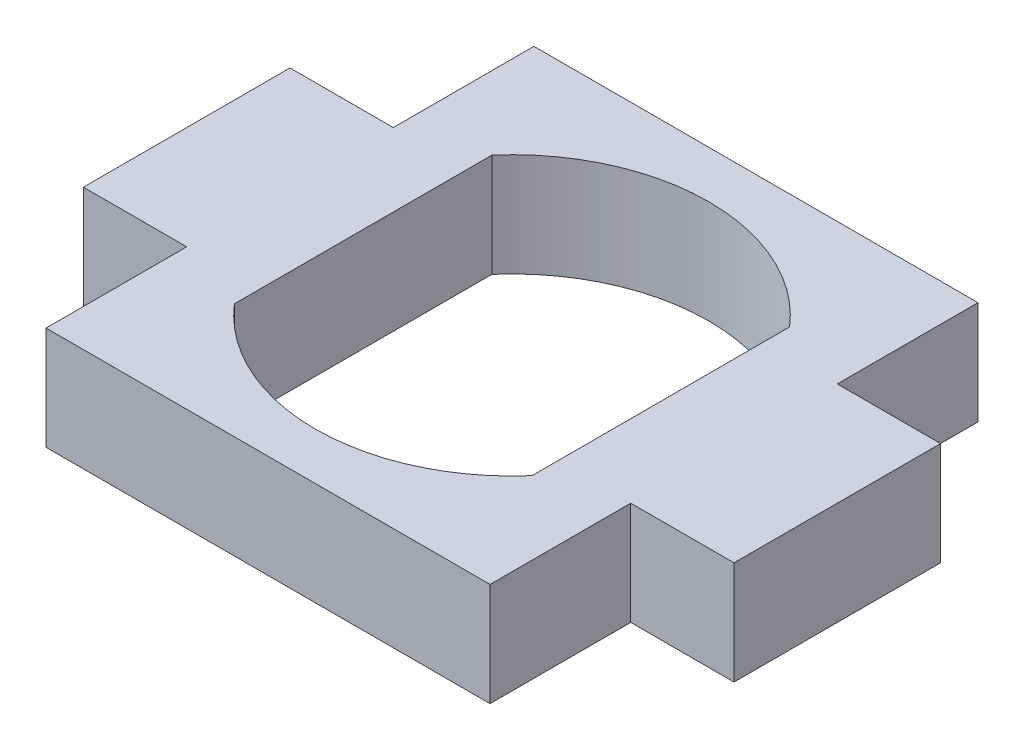
ISO-10303-21;
HEADER;
FILE_DESCRIPTION(('STEP AP214'),'2;1');
FILE_NAME('part.step','',(''),(''),'','','');
FILE_SCHEMA(('AUTOMOTIVE_DESIGN { 1 0 10303 214 1 1 1 1 }'));
ENDSEC;
DATA;
#1=APPLICATION_CONTEXT('core data for automotive mechanical design processes');
#2=APPLICATION_PROTOCOL_DEFINITION('international standard','automotive_design',2000,#1);
#3=PRODUCT_CONTEXT('',#1,'mechanical');
#4=PRODUCT('Part','Part','',(#3));
#5=PRODUCT_RELATED_PRODUCT_CATEGORY('part','',(#4));
#6=PRODUCT_DEFINITION_FORMATION('','',#4);
#7=PRODUCT_DEFINITION_CONTEXT('part definition',#1,'design');
#8=PRODUCT_DEFINITION('design','',#6,#7);
#9=PRODUCT_DEFINITION_SHAPE('','',#8);
#10=(LENGTH_UNIT() NAMED_UNIT(*) SI_UNIT(.MILLI.,.METRE.));
#11=(NAMED_UNIT(*) PLANE_ANGLE_UNIT() SI_UNIT($,.RADIAN.));
#12=(NAMED_UNIT(*) SI_UNIT($,.STERADIAN.) SOLID_ANGLE_UNIT());
#13=UNCERTAINTY_MEASURE_WITH_UNIT(LENGTH_MEASURE(1.E-05),#10,'distance_accuracy_value','');
#14=(GEOMETRIC_REPRESENTATION_CONTEXT(3) GLOBAL_UNCERTAINTY_ASSIGNED_CONTEXT((#13)) GLOBAL_UNIT_ASSIGNED_CONTEXT((#10,
#11,#12)) REPRESENTATION_CONTEXT('',''));
#15=CARTESIAN_POINT('',(0.,0.,0.));
#16=DIRECTION('',(0.,0.,1.));
#17=DIRECTION('',(1.,0.,0.));
#18=AXIS2_PLACEMENT_3D('',#15,#16,#17);
#19=CARTESIAN_POINT('',(-13.65,6.35,15.));
#20=DIRECTION('',(1.,0.,0.));
#21=DIRECTION('',(0.,0.,-1.));
#22=AXIS2_PLACEMENT_3D('',#19,#20,#21);
#23=PLANE('',#22);
#24=DIRECTION('',(0.,0.,1.));
#25=VECTOR('',#24,1.);
#26=CARTESIAN_POINT('',(-13.65,6.35,15.));
#27=LINE('',#26,#25);
#28=CARTESIAN_POINT('',(-13.65,6.35,6.35));
#29=VERTEX_POINT('',#28);
#30=CARTESIAN_POINT('',(-13.65,6.35,15.));
#31=VERTEX_POINT('',#30);
#32=EDGE_CURVE('E302',#29,#31,#27,.T.);
#33=ORIENTED_EDGE('',*,*,#32,.F.);
#34=DIRECTION('',(0.,-1.,0.));
#35=VECTOR('',#34,1.);
#36=CARTESIAN_POINT('',(-13.65,0.,6.35));
#37=LINE('',#36,#35);
#38=CARTESIAN_POINT('',(-13.65,0.,6.35));
#39=VERTEX_POINT('',#38);
#40=EDGE_CURVE('E171',#29,#39,#37,.T.);
#41=ORIENTED_EDGE('',*,*,#40,.T.);
#42=DIRECTION('',(0.,0.,1.));
#43=VECTOR('',#42,1.);
#44=CARTESIAN_POINT('',(-13.65,0.,15.));
#45=LINE('',#44,#43);
#46=CARTESIAN_POINT('',(-13.65,0.,15.));
#47=VERTEX_POINT('',#46);
#48=EDGE_CURVE('E261',#39,#47,#45,.T.);
#49=ORIENTED_EDGE('',*,*,#48,.T.);
#50=DIRECTION('',(0.,-1.,0.));
#51=VECTOR('',#50,1.);
#52=CARTESIAN_POINT('',(-13.65,6.35,15.));
#53=LINE('',#52,#51);
#54=EDGE_CURVE('E280',#31,#47,#53,.T.);
#55=ORIENTED_EDGE('',*,*,#54,.F.);
#56=EDGE_LOOP('',(#33,#41,#49,#55));
#57=FACE_BOUND('',#56,.T.);
#58=ADVANCED_FACE('F33',(#57),#23,.F.);
#59=CARTESIAN_POINT('',(13.65,6.35,15.));
#60=DIRECTION('',(-1.,0.,0.));
#61=DIRECTION('',(0.,0.,1.));
#62=AXIS2_PLACEMENT_3D('',#59,#60,#61);
#63=PLANE('',#62);
#64=DIRECTION('',(0.,-1.,0.));
#65=VECTOR('',#64,1.);
#66=CARTESIAN_POINT('',(13.65,0.,6.35));
#67=LINE('',#66,#65);
#68=CARTESIAN_POINT('',(13.65,6.35,6.35));
#69=VERTEX_POINT('',#68);
#70=CARTESIAN_POINT('',(13.65,0.,6.35));
#71=VERTEX_POINT('',#70);
#72=EDGE_CURVE('E200',#69,#71,#67,.T.);
#73=ORIENTED_EDGE('',*,*,#72,.F.);
#74=DIRECTION('',(0.,0.,-1.));
#75=VECTOR('',#74,1.);
#76=CARTESIAN_POINT('',(13.65,6.35,15.));
#77=LINE('',#76,#75);
#78=CARTESIAN_POINT('',(13.65,6.35,15.));
#79=VERTEX_POINT('',#78);
#80=EDGE_CURVE('E305',#79,#69,#77,.T.);
#81=ORIENTED_EDGE('',*,*,#80,.F.);
#82=DIRECTION('',(0.,-1.,0.));
#83=VECTOR('',#82,1.);
#84=CARTESIAN_POINT('',(13.65,6.35,15.));
#85=LINE('',#84,#83);
#86=CARTESIAN_POINT('',(13.65,0.,15.));
#87=VERTEX_POINT('',#86);
#88=EDGE_CURVE('E277',#79,#87,#85,.T.);
#89=ORIENTED_EDGE('',*,*,#88,.T.);
#90=DIRECTION('',(0.,0.,-1.));
#91=VECTOR('',#90,1.);
#92=CARTESIAN_POINT('',(13.65,0.,15.));
#93=LINE('',#92,#91);
#94=EDGE_CURVE('E287',#87,#71,#93,.T.);
#95=ORIENTED_EDGE('',*,*,#94,.T.);
#96=EDGE_LOOP('',(#73,#81,#89,#95));
#97=FACE_BOUND('',#96,.T.);
#98=ADVANCED_FACE('F35',(#97),#63,.F.);
#99=DIRECTION('',(0.,1.,0.));
#100=VECTOR('',#99,1.);
#101=CARTESIAN_POINT('',(13.65,0.,-6.35));
#102=LINE('',#101,#100);
#103=CARTESIAN_POINT('',(13.65,0.,-6.35));
#104=VERTEX_POINT('',#103);
#105=CARTESIAN_POINT('',(13.65,6.35,-6.35));
#106=VERTEX_POINT('',#105);
#107=EDGE_CURVE('E320',#104,#106,#102,.T.);
#108=ORIENTED_EDGE('',*,*,#107,.F.);
#109=CARTESIAN_POINT('',(13.65,0.,-15.));
#110=VERTEX_POINT('',#109);
#111=EDGE_CURVE('E289',#104,#110,#93,.T.);
#112=ORIENTED_EDGE('',*,*,#111,.T.);
#113=DIRECTION('',(0.,-1.,0.));
#114=VECTOR('',#113,1.);
#115=CARTESIAN_POINT('',(13.65,6.35,-15.));
#116=LINE('',#115,#114);
#117=CARTESIAN_POINT('',(13.65,6.35,-15.));
#118=VERTEX_POINT('',#117);
#119=EDGE_CURVE('E206',#118,#110,#116,.T.);
#120=ORIENTED_EDGE('',*,*,#119,.F.);
#121=EDGE_CURVE('E263',#106,#118,#77,.T.);
#122=ORIENTED_EDGE('',*,*,#121,.F.);
#123=EDGE_LOOP('',(#108,#112,#120,#122));
#124=FACE_BOUND('',#123,.T.);
#125=ADVANCED_FACE('F235',(#124),#63,.F.);
#126=CARTESIAN_POINT('',(-13.65,6.35,-15.));
#127=DIRECTION('',(0.,0.,1.));
#128=DIRECTION('',(1.,0.,0.));
#129=AXIS2_PLACEMENT_3D('',#126,#127,#128);
#130=PLANE('',#129);
#131=DIRECTION('',(-1.,0.,0.));
#132=VECTOR('',#131,1.);
#133=CARTESIAN_POINT('',(-13.65,0.,-15.));
#134=LINE('',#133,#132);
#135=CARTESIAN_POINT('',(-13.65,0.,-15.));
#136=VERTEX_POINT('',#135);
#137=EDGE_CURVE('E265',#110,#136,#134,.T.);
#138=ORIENTED_EDGE('',*,*,#137,.T.);
#139=DIRECTION('',(0.,-1.,0.));
#140=VECTOR('',#139,1.);
#141=CARTESIAN_POINT('',(-13.65,6.35,-15.));
#142=LINE('',#141,#140);
#143=CARTESIAN_POINT('',(-13.65,6.35,-15.));
#144=VERTEX_POINT('',#143);
#145=EDGE_CURVE('E258',#144,#136,#142,.T.);
#146=ORIENTED_EDGE('',*,*,#145,.F.);
#147=DIRECTION('',(-1.,0.,0.));
#148=VECTOR('',#147,1.);
#149=CARTESIAN_POINT('',(-13.65,6.35,-15.));
#150=LINE('',#149,#148);
#151=EDGE_CURVE('E298',#118,#144,#150,.T.);
#152=ORIENTED_EDGE('',*,*,#151,.F.);
#153=ORIENTED_EDGE('',*,*,#119,.T.);
#154=EDGE_LOOP('',(#138,#146,#152,#153));
#155=FACE_BOUND('',#154,.T.);
#156=ADVANCED_FACE('F241',(#155),#130,.F.);
#157=CARTESIAN_POINT('',(-13.65,0.,-6.35));
#158=VERTEX_POINT('',#157);
#159=EDGE_CURVE('E253',#136,#158,#45,.T.);
#160=ORIENTED_EDGE('',*,*,#159,.T.);
#161=DIRECTION('',(0.,1.,0.));
#162=VECTOR('',#161,1.);
#163=CARTESIAN_POINT('',(-13.65,0.,-6.35));
#164=LINE('',#163,#162);
#165=CARTESIAN_POINT('',(-13.65,6.35,-6.35));
#166=VERTEX_POINT('',#165);
#167=EDGE_CURVE('E178',#158,#166,#164,.T.);
#168=ORIENTED_EDGE('',*,*,#167,.T.);
#169=EDGE_CURVE('E295',#144,#166,#27,.T.);
#170=ORIENTED_EDGE('',*,*,#169,.F.);
#171=ORIENTED_EDGE('',*,*,#145,.T.);
#172=EDGE_LOOP('',(#160,#168,#170,#171));
#173=FACE_BOUND('',#172,.T.);
#174=ADVANCED_FACE('F231',(#173),#23,.F.);
#175=CARTESIAN_POINT('',(-13.65,6.35,15.));
#176=DIRECTION('',(0.,0.,-1.));
#177=DIRECTION('',(-1.,0.,0.));
#178=AXIS2_PLACEMENT_3D('',#175,#176,#177);
#179=PLANE('',#178);
#180=DIRECTION('',(1.,0.,0.));
#181=VECTOR('',#180,1.);
#182=CARTESIAN_POINT('',(-13.65,0.,15.));
#183=LINE('',#182,#181);
#184=EDGE_CURVE('E260',#47,#87,#183,.T.);
#185=ORIENTED_EDGE('',*,*,#184,.T.);
#186=ORIENTED_EDGE('',*,*,#88,.F.);
#187=DIRECTION('',(1.,0.,0.));
#188=VECTOR('',#187,1.);
#189=CARTESIAN_POINT('',(-13.65,6.35,15.));
#190=LINE('',#189,#188);
#191=EDGE_CURVE('E281',#31,#79,#190,.T.);
#192=ORIENTED_EDGE('',*,*,#191,.F.);
#193=ORIENTED_EDGE('',*,*,#54,.T.);
#194=EDGE_LOOP('',(#185,#186,#192,#193));
#195=FACE_BOUND('',#194,.T.);
#196=ADVANCED_FACE('F240',(#195),#179,.F.);
#197=CARTESIAN_POINT('',(0.,6.35,0.));
#198=DIRECTION('',(0.,-1.,0.));
#199=DIRECTION('',(0.,0.,-1.));
#200=AXIS2_PLACEMENT_3D('',#197,#198,#199);
#201=PLANE('',#200);
#202=DIRECTION('',(0.,0.,1.));
#203=VECTOR('',#202,1.);
#204=CARTESIAN_POINT('',(-9.15,6.35,7.91754381105656));
#205=LINE('',#204,#203);
#206=CARTESIAN_POINT('',(-9.15,6.35,-7.91754381105656));
#207=VERTEX_POINT('',#206);
#208=CARTESIAN_POINT('',(-9.15,6.35,7.91754381105656));
#209=VERTEX_POINT('',#208);
#210=EDGE_CURVE('E157',#207,#209,#205,.T.);
#211=ORIENTED_EDGE('',*,*,#210,.F.);
#212=CARTESIAN_POINT('',(0.,6.35,0.));
#213=DIRECTION('',(0.,1.,0.));
#214=DIRECTION('',(0.,0.,1.));
#215=AXIS2_PLACEMENT_3D('',#212,#213,#214);
#216=CIRCLE('',#215,12.1);
#217=CARTESIAN_POINT('',(9.15,6.35,-7.91754381105656));
#218=VERTEX_POINT('',#217);
#219=EDGE_CURVE('E48',#218,#207,#216,.T.);
#220=ORIENTED_EDGE('',*,*,#219,.F.);
#221=DIRECTION('',(0.,0.,-1.));
#222=VECTOR('',#221,1.);
#223=CARTESIAN_POINT('',(9.15,6.35,7.91754381105656));
#224=LINE('',#223,#222);
#225=CARTESIAN_POINT('',(9.15,6.35,7.91754381105656));
#226=VERTEX_POINT('',#225);
#227=EDGE_CURVE('E164',#226,#218,#224,.T.);
#228=ORIENTED_EDGE('',*,*,#227,.F.);
#229=CARTESIAN_POINT('',(0.,6.35,0.));
#230=DIRECTION('',(0.,1.,0.));
#231=DIRECTION('',(0.,0.,1.));
#232=AXIS2_PLACEMENT_3D('',#229,#230,#231);
#233=CIRCLE('',#232,12.1);
#234=EDGE_CURVE('E148',#209,#226,#233,.T.);
#235=ORIENTED_EDGE('',*,*,#234,.F.);
#236=EDGE_LOOP('',(#211,#220,#228,#235));
#237=FACE_BOUND('',#236,.T.);
#238=ORIENTED_EDGE('',*,*,#80,.T.);
#239=DIRECTION('',(-1.,0.,0.));
#240=VECTOR('',#239,1.);
#241=CARTESIAN_POINT('',(20.,6.35,6.35));
#242=LINE('',#241,#240);
#243=CARTESIAN_POINT('',(20.,6.35,6.35));
#244=VERTEX_POINT('',#243);
#245=EDGE_CURVE('E328',#244,#69,#242,.T.);
#246=ORIENTED_EDGE('',*,*,#245,.F.);
#247=DIRECTION('',(0.,0.,1.));
#248=VECTOR('',#247,1.);
#249=CARTESIAN_POINT('',(20.,6.35,-6.35));
#250=LINE('',#249,#248);
#251=CARTESIAN_POINT('',(20.,6.35,-6.35));
#252=VERTEX_POINT('',#251);
#253=EDGE_CURVE('E341',#252,#244,#250,.T.);
#254=ORIENTED_EDGE('',*,*,#253,.F.);
#255=DIRECTION('',(-1.,0.,0.));
#256=VECTOR('',#255,1.);
#257=CARTESIAN_POINT('',(20.,6.35,-6.35));
#258=LINE('',#257,#256);
#259=EDGE_CURVE('E324',#252,#106,#258,.T.);
#260=ORIENTED_EDGE('',*,*,#259,.T.);
#261=ORIENTED_EDGE('',*,*,#121,.T.);
#262=ORIENTED_EDGE('',*,*,#151,.T.);
#263=ORIENTED_EDGE('',*,*,#169,.T.);
#264=DIRECTION('',(1.,0.,0.));
#265=VECTOR('',#264,1.);
#266=CARTESIAN_POINT('',(-20.,6.35,-6.35));
#267=LINE('',#266,#265);
#268=CARTESIAN_POINT('',(-20.,6.35,-6.35));
#269=VERTEX_POINT('',#268);
#270=EDGE_CURVE('E201',#269,#166,#267,.T.);
#271=ORIENTED_EDGE('',*,*,#270,.F.);
#272=DIRECTION('',(0.,0.,1.));
#273=VECTOR('',#272,1.);
#274=CARTESIAN_POINT('',(-20.,6.35,-6.35));
#275=LINE('',#274,#273);
#276=CARTESIAN_POINT('',(-20.,6.35,6.35));
#277=VERTEX_POINT('',#276);
#278=EDGE_CURVE('E177',#269,#277,#275,.T.);
#279=ORIENTED_EDGE('',*,*,#278,.T.);
#280=DIRECTION('',(1.,0.,0.));
#281=VECTOR('',#280,1.);
#282=CARTESIAN_POINT('',(-20.,6.35,6.35));
#283=LINE('',#282,#281);
#284=EDGE_CURVE('E198',#277,#29,#283,.T.);
#285=ORIENTED_EDGE('',*,*,#284,.T.);
#286=ORIENTED_EDGE('',*,*,#32,.T.);
#287=ORIENTED_EDGE('',*,*,#191,.T.);
#288=EDGE_LOOP('',(#238,#246,#254,#260,#261,#262,#263,#271,#279,#285,#286,#287));
#289=FACE_BOUND('',#288,.T.);
#290=ADVANCED_FACE('F161',(#237,#289),#201,.F.);
#291=CARTESIAN_POINT('',(0.,0.,0.));
#292=DIRECTION('',(0.,-1.,0.));
#293=DIRECTION('',(0.,0.,-1.));
#294=AXIS2_PLACEMENT_3D('',#291,#292,#293);
#295=PLANE('',#294);
#296=CARTESIAN_POINT('',(0.,0.,0.));
#297=DIRECTION('',(0.,-1.,0.));
#298=DIRECTION('',(0.,0.,-1.));
#299=AXIS2_PLACEMENT_3D('',#296,#297,#298);
#300=CIRCLE('',#299,12.1);
#301=CARTESIAN_POINT('',(-9.15,0.,-7.91754381105656));
#302=VERTEX_POINT('',#301);
#303=CARTESIAN_POINT('',(9.15,0.,-7.91754381105656));
#304=VERTEX_POINT('',#303);
#305=EDGE_CURVE('E11',#302,#304,#300,.T.);
#306=ORIENTED_EDGE('',*,*,#305,.F.);
#307=DIRECTION('',(0.,0.,-1.));
#308=VECTOR('',#307,1.);
#309=CARTESIAN_POINT('',(-9.15,0.,0.));
#310=LINE('',#309,#308);
#311=CARTESIAN_POINT('',(-9.15,0.,7.91754381105656));
#312=VERTEX_POINT('',#311);
#313=EDGE_CURVE('E204',#312,#302,#310,.T.);
#314=ORIENTED_EDGE('',*,*,#313,.F.);
#315=CARTESIAN_POINT('',(0.,0.,0.));
#316=DIRECTION('',(0.,-1.,0.));
#317=DIRECTION('',(0.,0.,-1.));
#318=AXIS2_PLACEMENT_3D('',#315,#316,#317);
#319=CIRCLE('',#318,12.1);
#320=CARTESIAN_POINT('',(9.15,0.,7.91754381105656));
#321=VERTEX_POINT('',#320);
#322=EDGE_CURVE('E151',#321,#312,#319,.T.);
#323=ORIENTED_EDGE('',*,*,#322,.F.);
#324=DIRECTION('',(0.,0.,1.));
#325=VECTOR('',#324,1.);
#326=CARTESIAN_POINT('',(9.15,0.,0.));
#327=LINE('',#326,#325);
#328=EDGE_CURVE('E41',#304,#321,#327,.T.);
#329=ORIENTED_EDGE('',*,*,#328,.F.);
#330=EDGE_LOOP('',(#306,#314,#323,#329));
#331=FACE_BOUND('',#330,.T.);
#332=ORIENTED_EDGE('',*,*,#94,.F.);
#333=ORIENTED_EDGE('',*,*,#184,.F.);
#334=ORIENTED_EDGE('',*,*,#48,.F.);
#335=DIRECTION('',(1.,0.,0.));
#336=VECTOR('',#335,1.);
#337=CARTESIAN_POINT('',(-20.,0.,6.35));
#338=LINE('',#337,#336);
#339=CARTESIAN_POINT('',(-20.,0.,6.35));
#340=VERTEX_POINT('',#339);
#341=EDGE_CURVE('E187',#340,#39,#338,.T.);
#342=ORIENTED_EDGE('',*,*,#341,.F.);
#343=DIRECTION('',(0.,0.,-1.));
#344=VECTOR('',#343,1.);
#345=CARTESIAN_POINT('',(-20.,0.,-6.35));
#346=LINE('',#345,#344);
#347=CARTESIAN_POINT('',(-20.,0.,-6.35));
#348=VERTEX_POINT('',#347);
#349=EDGE_CURVE('E184',#340,#348,#346,.T.);
#350=ORIENTED_EDGE('',*,*,#349,.T.);
#351=DIRECTION('',(1.,0.,0.));
#352=VECTOR('',#351,1.);
#353=CARTESIAN_POINT('',(-20.,0.,-6.35));
#354=LINE('',#353,#352);
#355=EDGE_CURVE('E383',#348,#158,#354,.T.);
#356=ORIENTED_EDGE('',*,*,#355,.T.);
#357=ORIENTED_EDGE('',*,*,#159,.F.);
#358=ORIENTED_EDGE('',*,*,#137,.F.);
#359=ORIENTED_EDGE('',*,*,#111,.F.);
#360=DIRECTION('',(-1.,0.,0.));
#361=VECTOR('',#360,1.);
#362=CARTESIAN_POINT('',(20.,0.,-6.35));
#363=LINE('',#362,#361);
#364=CARTESIAN_POINT('',(20.,0.,-6.35));
#365=VERTEX_POINT('',#364);
#366=EDGE_CURVE('E327',#365,#104,#363,.T.);
#367=ORIENTED_EDGE('',*,*,#366,.F.);
#368=DIRECTION('',(0.,0.,-1.));
#369=VECTOR('',#368,1.);
#370=CARTESIAN_POINT('',(20.,0.,-6.35));
#371=LINE('',#370,#369);
#372=CARTESIAN_POINT('',(20.,0.,6.35));
#373=VERTEX_POINT('',#372);
#374=EDGE_CURVE('E348',#373,#365,#371,.T.);
#375=ORIENTED_EDGE('',*,*,#374,.F.);
#376=DIRECTION('',(-1.,0.,0.));
#377=VECTOR('',#376,1.);
#378=CARTESIAN_POINT('',(20.,0.,6.35));
#379=LINE('',#378,#377);
#380=EDGE_CURVE('E333',#373,#71,#379,.T.);
#381=ORIENTED_EDGE('',*,*,#380,.T.);
#382=EDGE_LOOP('',(#332,#333,#334,#342,#350,#356,#357,#358,#359,#367,#375,#381));
#383=FACE_BOUND('',#382,.T.);
#384=ADVANCED_FACE('F213',(#331,#383),#295,.T.);
#385=CARTESIAN_POINT('',(20.,0.,6.35));
#386=DIRECTION('',(0.,0.,-1.));
#387=DIRECTION('',(-1.,0.,0.));
#388=AXIS2_PLACEMENT_3D('',#385,#386,#387);
#389=PLANE('',#388);
#390=ORIENTED_EDGE('',*,*,#72,.T.);
#391=ORIENTED_EDGE('',*,*,#380,.F.);
#392=DIRECTION('',(0.,-1.,0.));
#393=VECTOR('',#392,1.);
#394=CARTESIAN_POINT('',(20.,0.,6.35));
#395=LINE('',#394,#393);
#396=EDGE_CURVE('E323',#244,#373,#395,.T.);
#397=ORIENTED_EDGE('',*,*,#396,.F.);
#398=ORIENTED_EDGE('',*,*,#245,.T.);
#399=EDGE_LOOP('',(#390,#391,#397,#398));
#400=FACE_BOUND('',#399,.T.);
#401=ADVANCED_FACE('F354',(#400),#389,.F.);
#402=CARTESIAN_POINT('',(20.,0.,-6.35));
#403=DIRECTION('',(0.,0.,1.));
#404=DIRECTION('',(1.,0.,0.));
#405=AXIS2_PLACEMENT_3D('',#402,#403,#404);
#406=PLANE('',#405);
#407=ORIENTED_EDGE('',*,*,#107,.T.);
#408=ORIENTED_EDGE('',*,*,#259,.F.);
#409=DIRECTION('',(0.,1.,0.));
#410=VECTOR('',#409,1.);
#411=CARTESIAN_POINT('',(20.,0.,-6.35));
#412=LINE('',#411,#410);
#413=EDGE_CURVE('E344',#365,#252,#412,.T.);
#414=ORIENTED_EDGE('',*,*,#413,.F.);
#415=ORIENTED_EDGE('',*,*,#366,.T.);
#416=EDGE_LOOP('',(#407,#408,#414,#415));
#417=FACE_BOUND('',#416,.T.);
#418=ADVANCED_FACE('F361',(#417),#406,.F.);
#419=CARTESIAN_POINT('',(20.,0.,0.));
#420=DIRECTION('',(1.,0.,0.));
#421=DIRECTION('',(0.,0.,-1.));
#422=AXIS2_PLACEMENT_3D('',#419,#420,#421);
#423=PLANE('',#422);
#424=ORIENTED_EDGE('',*,*,#396,.T.);
#425=ORIENTED_EDGE('',*,*,#374,.T.);
#426=ORIENTED_EDGE('',*,*,#413,.T.);
#427=ORIENTED_EDGE('',*,*,#253,.T.);
#428=EDGE_LOOP('',(#424,#425,#426,#427));
#429=FACE_BOUND('',#428,.T.);
#430=ADVANCED_FACE('F352',(#429),#423,.T.);
#431=CARTESIAN_POINT('',(-20.,0.,6.35));
#432=DIRECTION('',(0.,0.,1.));
#433=DIRECTION('',(1.,0.,0.));
#434=AXIS2_PLACEMENT_3D('',#431,#432,#433);
#435=PLANE('',#434);
#436=ORIENTED_EDGE('',*,*,#40,.F.);
#437=ORIENTED_EDGE('',*,*,#284,.F.);
#438=DIRECTION('',(0.,-1.,0.));
#439=VECTOR('',#438,1.);
#440=CARTESIAN_POINT('',(-20.,0.,6.35));
#441=LINE('',#440,#439);
#442=EDGE_CURVE('E174',#277,#340,#441,.T.);
#443=ORIENTED_EDGE('',*,*,#442,.T.);
#444=ORIENTED_EDGE('',*,*,#341,.T.);
#445=EDGE_LOOP('',(#436,#437,#443,#444));
#446=FACE_BOUND('',#445,.T.);
#447=ADVANCED_FACE('F375',(#446),#435,.T.);
#448=CARTESIAN_POINT('',(-20.,0.,-6.35));
#449=DIRECTION('',(0.,0.,-1.));
#450=DIRECTION('',(-1.,0.,0.));
#451=AXIS2_PLACEMENT_3D('',#448,#449,#450);
#452=PLANE('',#451);
#453=ORIENTED_EDGE('',*,*,#167,.F.);
#454=ORIENTED_EDGE('',*,*,#355,.F.);
#455=DIRECTION('',(0.,1.,0.));
#456=VECTOR('',#455,1.);
#457=CARTESIAN_POINT('',(-20.,0.,-6.35));
#458=LINE('',#457,#456);
#459=EDGE_CURVE('E181',#348,#269,#458,.T.);
#460=ORIENTED_EDGE('',*,*,#459,.T.);
#461=ORIENTED_EDGE('',*,*,#270,.T.);
#462=EDGE_LOOP('',(#453,#454,#460,#461));
#463=FACE_BOUND('',#462,.T.);
#464=ADVANCED_FACE('F224',(#463),#452,.T.);
#465=CARTESIAN_POINT('',(-20.,0.,0.));
#466=DIRECTION('',(-1.,0.,0.));
#467=DIRECTION('',(0.,0.,-1.));
#468=AXIS2_PLACEMENT_3D('',#465,#466,#467);
#469=PLANE('',#468);
#470=ORIENTED_EDGE('',*,*,#442,.F.);
#471=ORIENTED_EDGE('',*,*,#278,.F.);
#472=ORIENTED_EDGE('',*,*,#459,.F.);
#473=ORIENTED_EDGE('',*,*,#349,.F.);
#474=EDGE_LOOP('',(#470,#471,#472,#473));
#475=FACE_BOUND('',#474,.T.);
#476=ADVANCED_FACE('F217',(#475),#469,.T.);
#477=CARTESIAN_POINT('',(0.,-5.00000000014378E-05,0.));
#478=DIRECTION('',(0.,1.,0.));
#479=DIRECTION('',(0.,0.,1.));
#480=AXIS2_PLACEMENT_3D('',#477,#478,#479);
#481=CYLINDRICAL_SURFACE('',#480,12.1);
#482=ORIENTED_EDGE('',*,*,#305,.T.);
#483=DIRECTION('',(0.,1.,0.));
#484=VECTOR('',#483,1.);
#485=CARTESIAN_POINT('',(9.15,-5.00000000014378E-05,-7.91754381105656));
#486=LINE('',#485,#484);
#487=EDGE_CURVE('E169',#304,#218,#486,.T.);
#488=ORIENTED_EDGE('',*,*,#487,.T.);
#489=ORIENTED_EDGE('',*,*,#219,.T.);
#490=DIRECTION('',(0.,1.,0.));
#491=VECTOR('',#490,1.);
#492=CARTESIAN_POINT('',(-9.15,-5.00000000014378E-05,-7.91754381105656));
#493=LINE('',#492,#491);
#494=EDGE_CURVE('E154',#302,#207,#493,.T.);
#495=ORIENTED_EDGE('',*,*,#494,.F.);
#496=EDGE_LOOP('',(#482,#488,#489,#495));
#497=FACE_BOUND('',#496,.T.);
#498=ADVANCED_FACE('F215',(#497),#481,.F.);
#499=CARTESIAN_POINT('',(9.15,-5.00000000014378E-05,7.91754381105656));
#500=DIRECTION('',(1.,0.,0.));
#501=DIRECTION('',(0.,0.,-1.));
#502=AXIS2_PLACEMENT_3D('',#499,#500,#501);
#503=PLANE('',#502);
#504=ORIENTED_EDGE('',*,*,#328,.T.);
#505=DIRECTION('',(0.,1.,0.));
#506=VECTOR('',#505,1.);
#507=CARTESIAN_POINT('',(9.15,-5.00000000014378E-05,7.91754381105656));
#508=LINE('',#507,#506);
#509=EDGE_CURVE('E153',#321,#226,#508,.T.);
#510=ORIENTED_EDGE('',*,*,#509,.T.);
#511=ORIENTED_EDGE('',*,*,#227,.T.);
#512=ORIENTED_EDGE('',*,*,#487,.F.);
#513=EDGE_LOOP('',(#504,#510,#511,#512));
#514=FACE_BOUND('',#513,.T.);
#515=ADVANCED_FACE('F210',(#514),#503,.F.);
#516=CARTESIAN_POINT('',(0.,-5.00000000014378E-05,0.));
#517=DIRECTION('',(0.,1.,0.));
#518=DIRECTION('',(0.,0.,1.));
#519=AXIS2_PLACEMENT_3D('',#516,#517,#518);
#520=CYLINDRICAL_SURFACE('',#519,12.1);
#521=ORIENTED_EDGE('',*,*,#322,.T.);
#522=DIRECTION('',(0.,1.,0.));
#523=VECTOR('',#522,1.);
#524=CARTESIAN_POINT('',(-9.15,-5.00000000014378E-05,7.91754381105656));
#525=LINE('',#524,#523);
#526=EDGE_CURVE('E56',#312,#209,#525,.T.);
#527=ORIENTED_EDGE('',*,*,#526,.T.);
#528=ORIENTED_EDGE('',*,*,#234,.T.);
#529=ORIENTED_EDGE('',*,*,#509,.F.);
#530=EDGE_LOOP('',(#521,#527,#528,#529));
#531=FACE_BOUND('',#530,.T.);
#532=ADVANCED_FACE('F145',(#531),#520,.F.);
#533=CARTESIAN_POINT('',(-9.15,-5.00000000014378E-05,7.91754381105656));
#534=DIRECTION('',(-1.,0.,0.));
#535=DIRECTION('',(0.,0.,1.));
#536=AXIS2_PLACEMENT_3D('',#533,#534,#535);
#537=PLANE('',#536);
#538=ORIENTED_EDGE('',*,*,#313,.T.);
#539=ORIENTED_EDGE('',*,*,#494,.T.);
#540=ORIENTED_EDGE('',*,*,#210,.T.);
#541=ORIENTED_EDGE('',*,*,#526,.F.);
#542=EDGE_LOOP('',(#538,#539,#540,#541));
#543=FACE_BOUND('',#542,.T.);
#544=ADVANCED_FACE('F158',(#543),#537,.F.);
#545=CLOSED_SHELL('',(#58,#98,#125,#156,#174,#196,#290,#384,#401,#418,#430,#447,#464,#476,#498,
#515,#532,#544));
#546=MANIFOLD_SOLID_BREP('B2',#545);
#547=ADVANCED_BREP_SHAPE_REPRESENTATION('',(#18,#546),#14);
#548=SHAPE_DEFINITION_REPRESENTATION(#9,#547);
ENDSEC;
END-ISO-10303-21;
